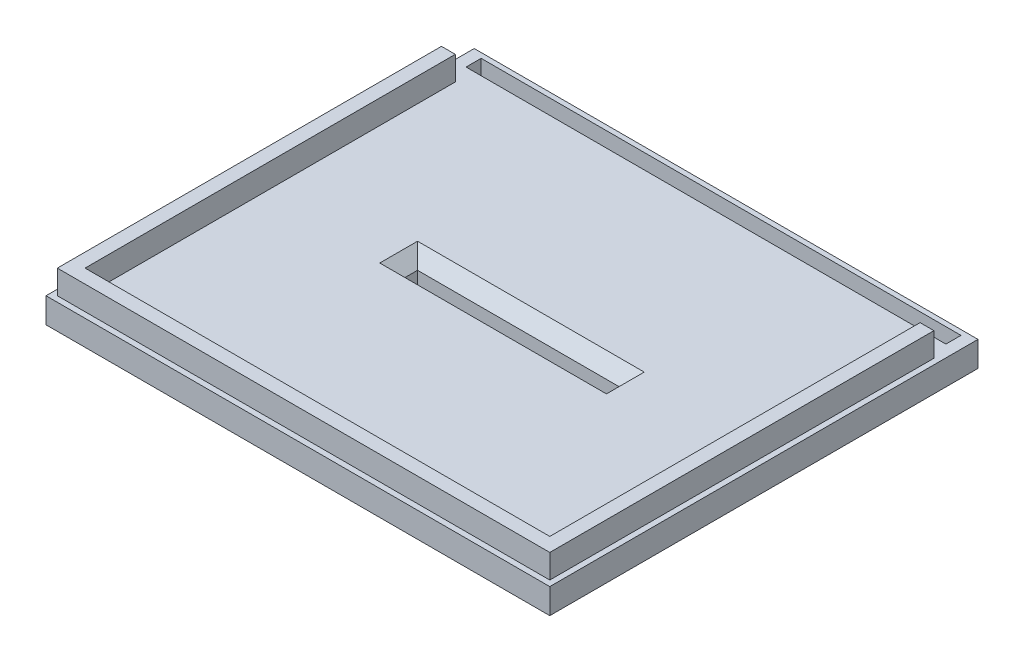
ISO-10303-21;
HEADER;
FILE_DESCRIPTION(('STEP AP214'),'2;1');
FILE_NAME('part.step','',(''),(''),'','','');
FILE_SCHEMA(('AUTOMOTIVE_DESIGN { 1 0 10303 214 1 1 1 1 }'));
ENDSEC;
DATA;
#1=APPLICATION_CONTEXT('core data for automotive mechanical design processes');
#2=APPLICATION_PROTOCOL_DEFINITION('international standard','automotive_design',2000,#1);
#3=PRODUCT_CONTEXT('',#1,'mechanical');
#4=PRODUCT('Part','Part','',(#3));
#5=PRODUCT_RELATED_PRODUCT_CATEGORY('part','',(#4));
#6=PRODUCT_DEFINITION_FORMATION('','',#4);
#7=PRODUCT_DEFINITION_CONTEXT('part definition',#1,'design');
#8=PRODUCT_DEFINITION('design','',#6,#7);
#9=PRODUCT_DEFINITION_SHAPE('','',#8);
#10=(LENGTH_UNIT() NAMED_UNIT(*) SI_UNIT(.MILLI.,.METRE.));
#11=(NAMED_UNIT(*) PLANE_ANGLE_UNIT() SI_UNIT($,.RADIAN.));
#12=(NAMED_UNIT(*) SI_UNIT($,.STERADIAN.) SOLID_ANGLE_UNIT());
#13=UNCERTAINTY_MEASURE_WITH_UNIT(LENGTH_MEASURE(1.E-05),#10,'distance_accuracy_value','');
#14=(GEOMETRIC_REPRESENTATION_CONTEXT(3) GLOBAL_UNCERTAINTY_ASSIGNED_CONTEXT((#13)) GLOBAL_UNIT_ASSIGNED_CONTEXT((#10,
#11,#12)) REPRESENTATION_CONTEXT('',''));
#15=CARTESIAN_POINT('',(0.,0.,0.));
#16=DIRECTION('',(0.,0.,1.));
#17=DIRECTION('',(1.,0.,0.));
#18=AXIS2_PLACEMENT_3D('',#15,#16,#17);
#19=CARTESIAN_POINT('',(0.,0.,0.));
#20=DIRECTION('',(0.,1.,0.));
#21=DIRECTION('',(0.,0.,1.));
#22=AXIS2_PLACEMENT_3D('',#19,#20,#21);
#23=PLANE('',#22);
#24=DIRECTION('',(0.,0.,1.));
#25=VECTOR('',#24,1.);
#26=CARTESIAN_POINT('',(39.9999999999999,0.,-2.5));
#27=LINE('',#26,#25);
#28=CARTESIAN_POINT('',(39.9999999999999,0.,-2.5));
#29=VERTEX_POINT('',#28);
#30=CARTESIAN_POINT('',(39.9999999999999,0.,2.5));
#31=VERTEX_POINT('',#30);
#32=EDGE_CURVE('E330',#29,#31,#27,.T.);
#33=ORIENTED_EDGE('',*,*,#32,.F.);
#34=DIRECTION('',(1.,0.,0.));
#35=VECTOR('',#34,1.);
#36=CARTESIAN_POINT('',(-40.,0.,-2.5));
#37=LINE('',#36,#35);
#38=CARTESIAN_POINT('',(-40.,0.,-2.5));
#39=VERTEX_POINT('',#38);
#40=EDGE_CURVE('E327',#39,#29,#37,.T.);
#41=ORIENTED_EDGE('',*,*,#40,.F.);
#42=DIRECTION('',(0.,0.,-1.));
#43=VECTOR('',#42,1.);
#44=CARTESIAN_POINT('',(-40.,0.,-2.5));
#45=LINE('',#44,#43);
#46=CARTESIAN_POINT('',(-40.,0.,2.5));
#47=VERTEX_POINT('',#46);
#48=EDGE_CURVE('E336',#47,#39,#45,.T.);
#49=ORIENTED_EDGE('',*,*,#48,.F.);
#50=DIRECTION('',(-1.,0.,0.));
#51=VECTOR('',#50,1.);
#52=CARTESIAN_POINT('',(-40.,0.,2.5));
#53=LINE('',#52,#51);
#54=EDGE_CURVE('E333',#31,#47,#53,.T.);
#55=ORIENTED_EDGE('',*,*,#54,.F.);
#56=EDGE_LOOP('',(#33,#41,#49,#55));
#57=FACE_BOUND('',#56,.T.);
#58=DIRECTION('',(1.,0.,0.));
#59=VECTOR('',#58,1.);
#60=CARTESIAN_POINT('',(-44.,0.,-5.25));
#61=LINE('',#60,#59);
#62=CARTESIAN_POINT('',(-44.,0.,-5.25));
#63=VERTEX_POINT('',#62);
#64=CARTESIAN_POINT('',(45.9999999999999,0.,-5.25));
#65=VERTEX_POINT('',#64);
#66=EDGE_CURVE('E289',#63,#65,#61,.T.);
#67=ORIENTED_EDGE('',*,*,#66,.T.);
#68=DIRECTION('',(0.,0.,-1.));
#69=VECTOR('',#68,1.);
#70=CARTESIAN_POINT('',(46.,0.,0.));
#71=LINE('',#70,#69);
#72=CARTESIAN_POINT('',(46.,0.,-7.25));
#73=VERTEX_POINT('',#72);
#74=EDGE_CURVE('E306',#65,#73,#71,.T.);
#75=ORIENTED_EDGE('',*,*,#74,.T.);
#76=DIRECTION('',(1.,0.,0.));
#77=VECTOR('',#76,1.);
#78=CARTESIAN_POINT('',(0.,0.,-7.25));
#79=LINE('',#78,#77);
#80=CARTESIAN_POINT('',(-46.,0.,-7.25));
#81=VERTEX_POINT('',#80);
#82=EDGE_CURVE('E312',#81,#73,#79,.T.);
#83=ORIENTED_EDGE('',*,*,#82,.F.);
#84=DIRECTION('',(0.,0.,-1.));
#85=VECTOR('',#84,1.);
#86=CARTESIAN_POINT('',(-46.,0.,0.));
#87=LINE('',#86,#85);
#88=CARTESIAN_POINT('',(-46.,0.,7.25));
#89=VERTEX_POINT('',#88);
#90=EDGE_CURVE('E309',#89,#81,#87,.T.);
#91=ORIENTED_EDGE('',*,*,#90,.F.);
#92=DIRECTION('',(1.,0.,0.));
#93=VECTOR('',#92,1.);
#94=CARTESIAN_POINT('',(0.,0.,7.25));
#95=LINE('',#94,#93);
#96=CARTESIAN_POINT('',(45.9999999999999,0.,7.25));
#97=VERTEX_POINT('',#96);
#98=EDGE_CURVE('E83',#89,#97,#95,.T.);
#99=ORIENTED_EDGE('',*,*,#98,.T.);
#100=CARTESIAN_POINT('',(46.,0.,5.25));
#101=VERTEX_POINT('',#100);
#102=EDGE_CURVE('E270',#97,#101,#71,.T.);
#103=ORIENTED_EDGE('',*,*,#102,.T.);
#104=DIRECTION('',(1.,0.,0.));
#105=VECTOR('',#104,1.);
#106=CARTESIAN_POINT('',(-44.,0.,5.25));
#107=LINE('',#106,#105);
#108=CARTESIAN_POINT('',(-44.,0.,5.25));
#109=VERTEX_POINT('',#108);
#110=EDGE_CURVE('E267',#109,#101,#107,.T.);
#111=ORIENTED_EDGE('',*,*,#110,.F.);
#112=DIRECTION('',(0.,0.,1.));
#113=VECTOR('',#112,1.);
#114=CARTESIAN_POINT('',(-44.,0.,0.));
#115=LINE('',#114,#113);
#116=EDGE_CURVE('E258',#63,#109,#115,.T.);
#117=ORIENTED_EDGE('',*,*,#116,.F.);
#118=EDGE_LOOP('',(#67,#75,#83,#91,#99,#103,#111,#117));
#119=FACE_BOUND('',#118,.T.);
#120=DIRECTION('',(1.,0.,0.));
#121=VECTOR('',#120,1.);
#122=CARTESIAN_POINT('',(0.,0.,-83.));
#123=LINE('',#122,#121);
#124=CARTESIAN_POINT('',(-95.2500000000001,0.,-83.));
#125=VERTEX_POINT('',#124);
#126=CARTESIAN_POINT('',(95.2499999999999,0.,-83.));
#127=VERTEX_POINT('',#126);
#128=EDGE_CURVE('E376',#125,#127,#123,.T.);
#129=ORIENTED_EDGE('',*,*,#128,.F.);
#130=DIRECTION('',(0.,0.,-1.));
#131=VECTOR('',#130,1.);
#132=CARTESIAN_POINT('',(-95.2499999999998,0.,2.22044604925031E-13));
#133=LINE('',#132,#131);
#134=CARTESIAN_POINT('',(-95.2499999999999,0.,-76.9999999999999));
#135=VERTEX_POINT('',#134);
#136=EDGE_CURVE('E362',#135,#125,#133,.T.);
#137=ORIENTED_EDGE('',*,*,#136,.F.);
#138=DIRECTION('',(1.,0.,0.));
#139=VECTOR('',#138,1.);
#140=CARTESIAN_POINT('',(0.,0.,-77.));
#141=LINE('',#140,#139);
#142=CARTESIAN_POINT('',(95.25,0.,-77.));
#143=VERTEX_POINT('',#142);
#144=EDGE_CURVE('E370',#135,#143,#141,.T.);
#145=ORIENTED_EDGE('',*,*,#144,.T.);
#146=DIRECTION('',(0.,0.,-1.));
#147=VECTOR('',#146,1.);
#148=CARTESIAN_POINT('',(95.2499999999999,0.,0.));
#149=LINE('',#148,#147);
#150=EDGE_CURVE('E373',#143,#127,#149,.T.);
#151=ORIENTED_EDGE('',*,*,#150,.T.);
#152=EDGE_LOOP('',(#129,#137,#145,#151));
#153=FACE_BOUND('',#152,.T.);
#154=DIRECTION('',(0.,0.,-1.));
#155=VECTOR('',#154,1.);
#156=CARTESIAN_POINT('',(-100.,0.,0.));
#157=LINE('',#156,#155);
#158=CARTESIAN_POINT('',(-100.,0.,85.));
#159=VERTEX_POINT('',#158);
#160=CARTESIAN_POINT('',(-100.,0.,-85.));
#161=VERTEX_POINT('',#160);
#162=EDGE_CURVE('E435',#159,#161,#157,.T.);
#163=ORIENTED_EDGE('',*,*,#162,.T.);
#164=DIRECTION('',(1.,0.,0.));
#165=VECTOR('',#164,1.);
#166=CARTESIAN_POINT('',(-100.,0.,-85.));
#167=LINE('',#166,#165);
#168=CARTESIAN_POINT('',(99.9999999999999,0.,-85.));
#169=VERTEX_POINT('',#168);
#170=EDGE_CURVE('E406',#161,#169,#167,.T.);
#171=ORIENTED_EDGE('',*,*,#170,.T.);
#172=DIRECTION('',(0.,0.,-1.));
#173=VECTOR('',#172,1.);
#174=CARTESIAN_POINT('',(99.9999999999999,0.,85.));
#175=LINE('',#174,#173);
#176=CARTESIAN_POINT('',(99.9999999999999,0.,85.));
#177=VERTEX_POINT('',#176);
#178=EDGE_CURVE('E451',#177,#169,#175,.T.);
#179=ORIENTED_EDGE('',*,*,#178,.F.);
#180=DIRECTION('',(1.,0.,0.));
#181=VECTOR('',#180,1.);
#182=CARTESIAN_POINT('',(0.,0.,85.));
#183=LINE('',#182,#181);
#184=EDGE_CURVE('E431',#159,#177,#183,.T.);
#185=ORIENTED_EDGE('',*,*,#184,.F.);
#186=EDGE_LOOP('',(#163,#171,#179,#185));
#187=FACE_BOUND('',#186,.T.);
#188=ADVANCED_FACE('F57',(#57,#119,#153,#187),#23,.F.);
#189=CARTESIAN_POINT('',(0.,10.,0.));
#190=DIRECTION('',(0.,1.,0.));
#191=DIRECTION('',(0.,0.,1.));
#192=AXIS2_PLACEMENT_3D('',#189,#190,#191);
#193=PLANE('',#192);
#194=DIRECTION('',(-1.,0.,0.));
#195=VECTOR('',#194,1.);
#196=CARTESIAN_POINT('',(-40.,10.,7.50000000000001));
#197=LINE('',#196,#195);
#198=CARTESIAN_POINT('',(45.,9.99999999999995,7.50000000000001));
#199=VERTEX_POINT('',#198);
#200=CARTESIAN_POINT('',(-45.,10.,7.50000000000001));
#201=VERTEX_POINT('',#200);
#202=EDGE_CURVE('E485',#199,#201,#197,.T.);
#203=ORIENTED_EDGE('',*,*,#202,.T.);
#204=DIRECTION('',(0.,0.,-1.));
#205=VECTOR('',#204,1.);
#206=CARTESIAN_POINT('',(-45.,10.,-2.5));
#207=LINE('',#206,#205);
#208=CARTESIAN_POINT('',(-45.,9.99999999999995,-7.50000000000001));
#209=VERTEX_POINT('',#208);
#210=EDGE_CURVE('E487',#201,#209,#207,.T.);
#211=ORIENTED_EDGE('',*,*,#210,.T.);
#212=DIRECTION('',(1.,0.,0.));
#213=VECTOR('',#212,1.);
#214=CARTESIAN_POINT('',(40.,9.99999999999995,-7.5));
#215=LINE('',#214,#213);
#216=CARTESIAN_POINT('',(44.9999999999999,9.99999999999995,-7.5));
#217=VERTEX_POINT('',#216);
#218=EDGE_CURVE('E481',#209,#217,#215,.T.);
#219=ORIENTED_EDGE('',*,*,#218,.T.);
#220=DIRECTION('',(0.,0.,1.));
#221=VECTOR('',#220,1.);
#222=CARTESIAN_POINT('',(44.9999999999999,9.99999999999995,2.50000000000001));
#223=LINE('',#222,#221);
#224=EDGE_CURVE('E483',#217,#199,#223,.T.);
#225=ORIENTED_EDGE('',*,*,#224,.T.);
#226=EDGE_LOOP('',(#203,#211,#219,#225));
#227=FACE_BOUND('',#226,.T.);
#228=DIRECTION('',(-1.,0.,0.));
#229=VECTOR('',#228,1.);
#230=CARTESIAN_POINT('',(0.,10.,-69.75));
#231=LINE('',#230,#229);
#232=CARTESIAN_POINT('',(-92.25,10.,-69.75));
#233=VERTEX_POINT('',#232);
#234=CARTESIAN_POINT('',(-97.75,10.,-69.75));
#235=VERTEX_POINT('',#234);
#236=EDGE_CURVE('E478',#233,#235,#231,.T.);
#237=ORIENTED_EDGE('',*,*,#236,.F.);
#238=DIRECTION('',(0.,0.,-1.));
#239=VECTOR('',#238,1.);
#240=CARTESIAN_POINT('',(-92.25,9.99999999999995,0.));
#241=LINE('',#240,#239);
#242=CARTESIAN_POINT('',(-92.2499999999999,10.,77.25));
#243=VERTEX_POINT('',#242);
#244=EDGE_CURVE('E446',#243,#233,#241,.T.);
#245=ORIENTED_EDGE('',*,*,#244,.F.);
#246=DIRECTION('',(-1.,0.,0.));
#247=VECTOR('',#246,1.);
#248=CARTESIAN_POINT('',(0.,10.,77.2500000000001));
#249=LINE('',#248,#247);
#250=CARTESIAN_POINT('',(92.2499999999999,10.,77.25));
#251=VERTEX_POINT('',#250);
#252=EDGE_CURVE('E460',#251,#243,#249,.T.);
#253=ORIENTED_EDGE('',*,*,#252,.F.);
#254=DIRECTION('',(0.,0.,1.));
#255=VECTOR('',#254,1.);
#256=CARTESIAN_POINT('',(92.2499999999999,9.99999999999995,0.));
#257=LINE('',#256,#255);
#258=CARTESIAN_POINT('',(92.25,10.,-69.75));
#259=VERTEX_POINT('',#258);
#260=EDGE_CURVE('E463',#259,#251,#257,.T.);
#261=ORIENTED_EDGE('',*,*,#260,.F.);
#262=DIRECTION('',(-1.,0.,0.));
#263=VECTOR('',#262,1.);
#264=CARTESIAN_POINT('',(0.,10.,-69.75));
#265=LINE('',#264,#263);
#266=CARTESIAN_POINT('',(97.7499999999999,10.,-69.75));
#267=VERTEX_POINT('',#266);
#268=EDGE_CURVE('E466',#267,#259,#265,.T.);
#269=ORIENTED_EDGE('',*,*,#268,.F.);
#270=DIRECTION('',(0.,0.,-1.));
#271=VECTOR('',#270,1.);
#272=CARTESIAN_POINT('',(97.7499999999999,9.99999999999995,0.));
#273=LINE('',#272,#271);
#274=CARTESIAN_POINT('',(97.7499999999999,10.,82.75));
#275=VERTEX_POINT('',#274);
#276=EDGE_CURVE('E469',#275,#267,#273,.T.);
#277=ORIENTED_EDGE('',*,*,#276,.F.);
#278=DIRECTION('',(1.,0.,0.));
#279=VECTOR('',#278,1.);
#280=CARTESIAN_POINT('',(0.,10.,82.75));
#281=LINE('',#280,#279);
#282=CARTESIAN_POINT('',(-97.75,10.,82.75));
#283=VERTEX_POINT('',#282);
#284=EDGE_CURVE('E472',#283,#275,#281,.T.);
#285=ORIENTED_EDGE('',*,*,#284,.F.);
#286=DIRECTION('',(0.,0.,1.));
#287=VECTOR('',#286,1.);
#288=CARTESIAN_POINT('',(-97.7499999999999,9.99999999999995,0.));
#289=LINE('',#288,#287);
#290=EDGE_CURVE('E475',#235,#283,#289,.T.);
#291=ORIENTED_EDGE('',*,*,#290,.F.);
#292=EDGE_LOOP('',(#237,#245,#253,#261,#269,#277,#285,#291));
#293=FACE_BOUND('',#292,.T.);
#294=DIRECTION('',(1.,0.,0.));
#295=VECTOR('',#294,1.);
#296=CARTESIAN_POINT('',(0.,10.,85.));
#297=LINE('',#296,#295);
#298=CARTESIAN_POINT('',(-100.,10.,85.));
#299=VERTEX_POINT('',#298);
#300=CARTESIAN_POINT('',(100.,10.,85.));
#301=VERTEX_POINT('',#300);
#302=EDGE_CURVE('E430',#299,#301,#297,.T.);
#303=ORIENTED_EDGE('',*,*,#302,.T.);
#304=DIRECTION('',(0.,0.,-1.));
#305=VECTOR('',#304,1.);
#306=CARTESIAN_POINT('',(100.,10.,85.));
#307=LINE('',#306,#305);
#308=CARTESIAN_POINT('',(99.9999999999999,10.,-85.));
#309=VERTEX_POINT('',#308);
#310=EDGE_CURVE('E450',#301,#309,#307,.T.);
#311=ORIENTED_EDGE('',*,*,#310,.T.);
#312=DIRECTION('',(1.,0.,0.));
#313=VECTOR('',#312,1.);
#314=CARTESIAN_POINT('',(-100.,10.,-85.));
#315=LINE('',#314,#313);
#316=CARTESIAN_POINT('',(-100.,10.,-85.));
#317=VERTEX_POINT('',#316);
#318=EDGE_CURVE('E447',#317,#309,#315,.T.);
#319=ORIENTED_EDGE('',*,*,#318,.F.);
#320=DIRECTION('',(0.,0.,-1.));
#321=VECTOR('',#320,1.);
#322=CARTESIAN_POINT('',(-100.,9.99999999999995,0.));
#323=LINE('',#322,#321);
#324=EDGE_CURVE('E427',#299,#317,#323,.T.);
#325=ORIENTED_EDGE('',*,*,#324,.F.);
#326=EDGE_LOOP('',(#303,#311,#319,#325));
#327=FACE_BOUND('',#326,.T.);
#328=DIRECTION('',(0.,0.,-1.));
#329=VECTOR('',#328,1.);
#330=CARTESIAN_POINT('',(-95.2499999999998,9.99999999999995,2.25514051876985E-13));
#331=LINE('',#330,#329);
#332=CARTESIAN_POINT('',(-95.2499999999999,10.,-77.));
#333=VERTEX_POINT('',#332);
#334=CARTESIAN_POINT('',(-95.2500000000001,10.,-83.));
#335=VERTEX_POINT('',#334);
#336=EDGE_CURVE('E350',#333,#335,#331,.T.);
#337=ORIENTED_EDGE('',*,*,#336,.T.);
#338=DIRECTION('',(1.,0.,0.));
#339=VECTOR('',#338,1.);
#340=CARTESIAN_POINT('',(0.,10.,-83.));
#341=LINE('',#340,#339);
#342=CARTESIAN_POINT('',(95.2499999999999,10.,-83.));
#343=VERTEX_POINT('',#342);
#344=EDGE_CURVE('E342',#335,#343,#341,.T.);
#345=ORIENTED_EDGE('',*,*,#344,.T.);
#346=DIRECTION('',(0.,0.,-1.));
#347=VECTOR('',#346,1.);
#348=CARTESIAN_POINT('',(95.2499999999999,9.99999999999995,0.));
#349=LINE('',#348,#347);
#350=CARTESIAN_POINT('',(95.25,10.,-77.));
#351=VERTEX_POINT('',#350);
#352=EDGE_CURVE('E356',#351,#343,#349,.T.);
#353=ORIENTED_EDGE('',*,*,#352,.F.);
#354=DIRECTION('',(1.,0.,0.));
#355=VECTOR('',#354,1.);
#356=CARTESIAN_POINT('',(0.,10.,-77.));
#357=LINE('',#356,#355);
#358=EDGE_CURVE('E353',#333,#351,#357,.T.);
#359=ORIENTED_EDGE('',*,*,#358,.F.);
#360=EDGE_LOOP('',(#337,#345,#353,#359));
#361=FACE_BOUND('',#360,.T.);
#362=ADVANCED_FACE('F538',(#227,#293,#327,#361),#193,.T.);
#363=CARTESIAN_POINT('',(0.,10.,85.));
#364=DIRECTION('',(0.,0.,-1.));
#365=DIRECTION('',(-1.,0.,0.));
#366=AXIS2_PLACEMENT_3D('',#363,#364,#365);
#367=PLANE('',#366);
#368=ORIENTED_EDGE('',*,*,#184,.T.);
#369=DIRECTION('',(0.,-1.,0.));
#370=VECTOR('',#369,1.);
#371=CARTESIAN_POINT('',(100.,10.,85.));
#372=LINE('',#371,#370);
#373=EDGE_CURVE('E434',#301,#177,#372,.T.);
#374=ORIENTED_EDGE('',*,*,#373,.F.);
#375=ORIENTED_EDGE('',*,*,#302,.F.);
#376=DIRECTION('',(0.,-1.,0.));
#377=VECTOR('',#376,1.);
#378=CARTESIAN_POINT('',(-100.,10.,85.));
#379=LINE('',#378,#377);
#380=EDGE_CURVE('E442',#299,#159,#379,.T.);
#381=ORIENTED_EDGE('',*,*,#380,.T.);
#382=EDGE_LOOP('',(#368,#374,#375,#381));
#383=FACE_BOUND('',#382,.T.);
#384=ADVANCED_FACE('F541',(#383),#367,.F.);
#385=CARTESIAN_POINT('',(-100.,9.99999999999995,0.));
#386=DIRECTION('',(-1.,0.,0.));
#387=DIRECTION('',(0.,0.,1.));
#388=AXIS2_PLACEMENT_3D('',#385,#386,#387);
#389=PLANE('',#388);
#390=ORIENTED_EDGE('',*,*,#162,.F.);
#391=ORIENTED_EDGE('',*,*,#380,.F.);
#392=ORIENTED_EDGE('',*,*,#324,.T.);
#393=DIRECTION('',(0.,-1.,0.));
#394=VECTOR('',#393,1.);
#395=CARTESIAN_POINT('',(-100.,10.,-85.));
#396=LINE('',#395,#394);
#397=EDGE_CURVE('E444',#317,#161,#396,.T.);
#398=ORIENTED_EDGE('',*,*,#397,.T.);
#399=EDGE_LOOP('',(#390,#391,#392,#398));
#400=FACE_BOUND('',#399,.T.);
#401=ADVANCED_FACE('F581',(#400),#389,.T.);
#402=CARTESIAN_POINT('',(-100.,10.,-85.));
#403=DIRECTION('',(0.,0.,-1.));
#404=DIRECTION('',(-1.,0.,0.));
#405=AXIS2_PLACEMENT_3D('',#402,#403,#404);
#406=PLANE('',#405);
#407=ORIENTED_EDGE('',*,*,#170,.F.);
#408=ORIENTED_EDGE('',*,*,#397,.F.);
#409=ORIENTED_EDGE('',*,*,#318,.T.);
#410=DIRECTION('',(0.,-1.,0.));
#411=VECTOR('',#410,1.);
#412=CARTESIAN_POINT('',(99.9999999999999,10.,-85.));
#413=LINE('',#412,#411);
#414=EDGE_CURVE('E438',#309,#169,#413,.T.);
#415=ORIENTED_EDGE('',*,*,#414,.T.);
#416=EDGE_LOOP('',(#407,#408,#409,#415));
#417=FACE_BOUND('',#416,.T.);
#418=ADVANCED_FACE('F585',(#417),#406,.T.);
#419=CARTESIAN_POINT('',(100.,10.,85.));
#420=DIRECTION('',(-1.,0.,0.));
#421=DIRECTION('',(0.,0.,1.));
#422=AXIS2_PLACEMENT_3D('',#419,#420,#421);
#423=PLANE('',#422);
#424=ORIENTED_EDGE('',*,*,#178,.T.);
#425=ORIENTED_EDGE('',*,*,#414,.F.);
#426=ORIENTED_EDGE('',*,*,#310,.F.);
#427=ORIENTED_EDGE('',*,*,#373,.T.);
#428=EDGE_LOOP('',(#424,#425,#426,#427));
#429=FACE_BOUND('',#428,.T.);
#430=ADVANCED_FACE('F587',(#429),#423,.F.);
#431=CARTESIAN_POINT('',(-97.75,19.5,-69.75));
#432=DIRECTION('',(0.,0.,-1.));
#433=DIRECTION('',(-1.,0.,0.));
#434=AXIS2_PLACEMENT_3D('',#431,#432,#433);
#435=PLANE('',#434);
#436=DIRECTION('',(0.,-1.,0.));
#437=VECTOR('',#436,1.);
#438=CARTESIAN_POINT('',(-92.25,19.5,-69.75));
#439=LINE('',#438,#437);
#440=CARTESIAN_POINT('',(-92.25,19.5,-69.75));
#441=VERTEX_POINT('',#440);
#442=EDGE_CURVE('E402',#441,#233,#439,.T.);
#443=ORIENTED_EDGE('',*,*,#442,.T.);
#444=ORIENTED_EDGE('',*,*,#236,.T.);
#445=DIRECTION('',(0.,-1.,0.));
#446=VECTOR('',#445,1.);
#447=CARTESIAN_POINT('',(-97.75,19.5,-69.75));
#448=LINE('',#447,#446);
#449=CARTESIAN_POINT('',(-97.75,19.5,-69.75));
#450=VERTEX_POINT('',#449);
#451=EDGE_CURVE('E403',#450,#235,#448,.T.);
#452=ORIENTED_EDGE('',*,*,#451,.F.);
#453=DIRECTION('',(1.,0.,0.));
#454=VECTOR('',#453,1.);
#455=CARTESIAN_POINT('',(-97.75,19.5,-69.75));
#456=LINE('',#455,#454);
#457=EDGE_CURVE('E378',#450,#441,#456,.T.);
#458=ORIENTED_EDGE('',*,*,#457,.T.);
#459=EDGE_LOOP('',(#443,#444,#452,#458));
#460=FACE_BOUND('',#459,.T.);
#461=ADVANCED_FACE('F590',(#460),#435,.T.);
#462=CARTESIAN_POINT('',(-97.75,19.5,82.7500000000001));
#463=DIRECTION('',(-1.,0.,0.));
#464=DIRECTION('',(0.,0.,1.));
#465=AXIS2_PLACEMENT_3D('',#462,#463,#464);
#466=PLANE('',#465);
#467=ORIENTED_EDGE('',*,*,#451,.T.);
#468=ORIENTED_EDGE('',*,*,#290,.T.);
#469=DIRECTION('',(0.,-1.,0.));
#470=VECTOR('',#469,1.);
#471=CARTESIAN_POINT('',(-97.75,19.5,82.7500000000001));
#472=LINE('',#471,#470);
#473=CARTESIAN_POINT('',(-97.75,19.5,82.7500000000001));
#474=VERTEX_POINT('',#473);
#475=EDGE_CURVE('E407',#474,#283,#472,.T.);
#476=ORIENTED_EDGE('',*,*,#475,.F.);
#477=DIRECTION('',(0.,0.,-1.));
#478=VECTOR('',#477,1.);
#479=CARTESIAN_POINT('',(-97.75,19.5,82.7500000000001));
#480=LINE('',#479,#478);
#481=EDGE_CURVE('E399',#474,#450,#480,.T.);
#482=ORIENTED_EDGE('',*,*,#481,.T.);
#483=EDGE_LOOP('',(#467,#468,#476,#482));
#484=FACE_BOUND('',#483,.T.);
#485=ADVANCED_FACE('F734',(#484),#466,.T.);
#486=CARTESIAN_POINT('',(97.7499999999999,19.5,82.75));
#487=DIRECTION('',(0.,0.,1.));
#488=DIRECTION('',(1.,0.,0.));
#489=AXIS2_PLACEMENT_3D('',#486,#487,#488);
#490=PLANE('',#489);
#491=ORIENTED_EDGE('',*,*,#475,.T.);
#492=ORIENTED_EDGE('',*,*,#284,.T.);
#493=DIRECTION('',(0.,-1.,0.));
#494=VECTOR('',#493,1.);
#495=CARTESIAN_POINT('',(97.7499999999999,19.5,82.75));
#496=LINE('',#495,#494);
#497=CARTESIAN_POINT('',(97.7499999999999,19.5,82.75));
#498=VERTEX_POINT('',#497);
#499=EDGE_CURVE('E410',#498,#275,#496,.T.);
#500=ORIENTED_EDGE('',*,*,#499,.F.);
#501=DIRECTION('',(-1.,0.,0.));
#502=VECTOR('',#501,1.);
#503=CARTESIAN_POINT('',(97.7499999999999,19.5,82.75));
#504=LINE('',#503,#502);
#505=EDGE_CURVE('E396',#498,#474,#504,.T.);
#506=ORIENTED_EDGE('',*,*,#505,.T.);
#507=EDGE_LOOP('',(#491,#492,#500,#506));
#508=FACE_BOUND('',#507,.T.);
#509=ADVANCED_FACE('F743',(#508),#490,.T.);
#510=CARTESIAN_POINT('',(97.7499999999999,19.5,-69.75));
#511=DIRECTION('',(1.,0.,0.));
#512=DIRECTION('',(0.,0.,-1.));
#513=AXIS2_PLACEMENT_3D('',#510,#511,#512);
#514=PLANE('',#513);
#515=ORIENTED_EDGE('',*,*,#499,.T.);
#516=ORIENTED_EDGE('',*,*,#276,.T.);
#517=DIRECTION('',(0.,-1.,0.));
#518=VECTOR('',#517,1.);
#519=CARTESIAN_POINT('',(97.7499999999999,19.5,-69.75));
#520=LINE('',#519,#518);
#521=CARTESIAN_POINT('',(97.7499999999999,19.5,-69.75));
#522=VERTEX_POINT('',#521);
#523=EDGE_CURVE('E413',#522,#267,#520,.T.);
#524=ORIENTED_EDGE('',*,*,#523,.F.);
#525=DIRECTION('',(0.,0.,1.));
#526=VECTOR('',#525,1.);
#527=CARTESIAN_POINT('',(97.7499999999999,19.5,-69.75));
#528=LINE('',#527,#526);
#529=EDGE_CURVE('E393',#522,#498,#528,.T.);
#530=ORIENTED_EDGE('',*,*,#529,.T.);
#531=EDGE_LOOP('',(#515,#516,#524,#530));
#532=FACE_BOUND('',#531,.T.);
#533=ADVANCED_FACE('F753',(#532),#514,.T.);
#534=CARTESIAN_POINT('',(92.25,19.5,-69.75));
#535=DIRECTION('',(0.,0.,-1.));
#536=DIRECTION('',(-1.,0.,0.));
#537=AXIS2_PLACEMENT_3D('',#534,#535,#536);
#538=PLANE('',#537);
#539=ORIENTED_EDGE('',*,*,#523,.T.);
#540=ORIENTED_EDGE('',*,*,#268,.T.);
#541=DIRECTION('',(0.,-1.,0.));
#542=VECTOR('',#541,1.);
#543=CARTESIAN_POINT('',(92.25,19.5,-69.75));
#544=LINE('',#543,#542);
#545=CARTESIAN_POINT('',(92.25,19.5,-69.75));
#546=VERTEX_POINT('',#545);
#547=EDGE_CURVE('E416',#546,#259,#544,.T.);
#548=ORIENTED_EDGE('',*,*,#547,.F.);
#549=DIRECTION('',(1.,0.,0.));
#550=VECTOR('',#549,1.);
#551=CARTESIAN_POINT('',(92.25,19.5,-69.75));
#552=LINE('',#551,#550);
#553=EDGE_CURVE('E390',#546,#522,#552,.T.);
#554=ORIENTED_EDGE('',*,*,#553,.T.);
#555=EDGE_LOOP('',(#539,#540,#548,#554));
#556=FACE_BOUND('',#555,.T.);
#557=ADVANCED_FACE('F763',(#556),#538,.T.);
#558=CARTESIAN_POINT('',(92.2499999999999,19.5,77.25));
#559=DIRECTION('',(-1.,0.,0.));
#560=DIRECTION('',(0.,0.,1.));
#561=AXIS2_PLACEMENT_3D('',#558,#559,#560);
#562=PLANE('',#561);
#563=ORIENTED_EDGE('',*,*,#547,.T.);
#564=ORIENTED_EDGE('',*,*,#260,.T.);
#565=DIRECTION('',(0.,-1.,0.));
#566=VECTOR('',#565,1.);
#567=CARTESIAN_POINT('',(92.2499999999999,19.5,77.25));
#568=LINE('',#567,#566);
#569=CARTESIAN_POINT('',(92.2499999999999,19.5,77.25));
#570=VERTEX_POINT('',#569);
#571=EDGE_CURVE('E419',#570,#251,#568,.T.);
#572=ORIENTED_EDGE('',*,*,#571,.F.);
#573=DIRECTION('',(0.,0.,-1.));
#574=VECTOR('',#573,1.);
#575=CARTESIAN_POINT('',(92.2499999999999,19.5,77.25));
#576=LINE('',#575,#574);
#577=EDGE_CURVE('E387',#570,#546,#576,.T.);
#578=ORIENTED_EDGE('',*,*,#577,.T.);
#579=EDGE_LOOP('',(#563,#564,#572,#578));
#580=FACE_BOUND('',#579,.T.);
#581=ADVANCED_FACE('F773',(#580),#562,.T.);
#582=CARTESIAN_POINT('',(-92.2499999999999,19.5,77.25));
#583=DIRECTION('',(0.,0.,-1.));
#584=DIRECTION('',(-1.,0.,0.));
#585=AXIS2_PLACEMENT_3D('',#582,#583,#584);
#586=PLANE('',#585);
#587=ORIENTED_EDGE('',*,*,#571,.T.);
#588=ORIENTED_EDGE('',*,*,#252,.T.);
#589=DIRECTION('',(0.,-1.,0.));
#590=VECTOR('',#589,1.);
#591=CARTESIAN_POINT('',(-92.2499999999999,19.5,77.25));
#592=LINE('',#591,#590);
#593=CARTESIAN_POINT('',(-92.2499999999999,19.5,77.25));
#594=VERTEX_POINT('',#593);
#595=EDGE_CURVE('E422',#594,#243,#592,.T.);
#596=ORIENTED_EDGE('',*,*,#595,.F.);
#597=DIRECTION('',(1.,0.,0.));
#598=VECTOR('',#597,1.);
#599=CARTESIAN_POINT('',(-92.2499999999999,19.5,77.25));
#600=LINE('',#599,#598);
#601=EDGE_CURVE('E384',#594,#570,#600,.T.);
#602=ORIENTED_EDGE('',*,*,#601,.T.);
#603=EDGE_LOOP('',(#587,#588,#596,#602));
#604=FACE_BOUND('',#603,.T.);
#605=ADVANCED_FACE('F783',(#604),#586,.T.);
#606=CARTESIAN_POINT('',(-92.25,19.5,-69.75));
#607=DIRECTION('',(1.,0.,0.));
#608=DIRECTION('',(0.,0.,-1.));
#609=AXIS2_PLACEMENT_3D('',#606,#607,#608);
#610=PLANE('',#609);
#611=ORIENTED_EDGE('',*,*,#595,.T.);
#612=ORIENTED_EDGE('',*,*,#244,.T.);
#613=ORIENTED_EDGE('',*,*,#442,.F.);
#614=DIRECTION('',(0.,0.,1.));
#615=VECTOR('',#614,1.);
#616=CARTESIAN_POINT('',(-92.25,19.5,-69.75));
#617=LINE('',#616,#615);
#618=EDGE_CURVE('E381',#441,#594,#617,.T.);
#619=ORIENTED_EDGE('',*,*,#618,.T.);
#620=EDGE_LOOP('',(#611,#612,#613,#619));
#621=FACE_BOUND('',#620,.T.);
#622=ADVANCED_FACE('F793',(#621),#610,.T.);
#623=CARTESIAN_POINT('',(0.,19.5,0.));
#624=DIRECTION('',(0.,-1.,0.));
#625=DIRECTION('',(0.,0.,-1.));
#626=AXIS2_PLACEMENT_3D('',#623,#624,#625);
#627=PLANE('',#626);
#628=ORIENTED_EDGE('',*,*,#457,.F.);
#629=ORIENTED_EDGE('',*,*,#481,.F.);
#630=ORIENTED_EDGE('',*,*,#505,.F.);
#631=ORIENTED_EDGE('',*,*,#529,.F.);
#632=ORIENTED_EDGE('',*,*,#553,.F.);
#633=ORIENTED_EDGE('',*,*,#577,.F.);
#634=ORIENTED_EDGE('',*,*,#601,.F.);
#635=ORIENTED_EDGE('',*,*,#618,.F.);
#636=EDGE_LOOP('',(#628,#629,#630,#631,#632,#633,#634,#635));
#637=FACE_BOUND('',#636,.T.);
#638=ADVANCED_FACE('F803',(#637),#627,.F.);
#639=CARTESIAN_POINT('',(0.,-9.99999999999995,-83.));
#640=DIRECTION('',(0.,0.,1.));
#641=DIRECTION('',(1.,0.,0.));
#642=AXIS2_PLACEMENT_3D('',#639,#640,#641);
#643=PLANE('',#642);
#644=ORIENTED_EDGE('',*,*,#128,.T.);
#645=DIRECTION('',(0.,1.,0.));
#646=VECTOR('',#645,1.);
#647=CARTESIAN_POINT('',(95.2499999999999,-10.,-83.));
#648=LINE('',#647,#646);
#649=EDGE_CURVE('E360',#127,#343,#648,.T.);
#650=ORIENTED_EDGE('',*,*,#649,.T.);
#651=ORIENTED_EDGE('',*,*,#344,.F.);
#652=DIRECTION('',(0.,1.,0.));
#653=VECTOR('',#652,1.);
#654=CARTESIAN_POINT('',(-95.2500000000001,-10.,-83.));
#655=LINE('',#654,#653);
#656=EDGE_CURVE('E359',#125,#335,#655,.T.);
#657=ORIENTED_EDGE('',*,*,#656,.F.);
#658=EDGE_LOOP('',(#644,#650,#651,#657));
#659=FACE_BOUND('',#658,.T.);
#660=ADVANCED_FACE('F557',(#659),#643,.T.);
#661=CARTESIAN_POINT('',(95.2499999999999,-10.,0.));
#662=DIRECTION('',(1.,0.,0.));
#663=DIRECTION('',(0.,0.,-1.));
#664=AXIS2_PLACEMENT_3D('',#661,#662,#663);
#665=PLANE('',#664);
#666=DIRECTION('',(0.,1.,0.));
#667=VECTOR('',#666,1.);
#668=CARTESIAN_POINT('',(95.25,-10.,-77.));
#669=LINE('',#668,#667);
#670=EDGE_CURVE('E363',#143,#351,#669,.T.);
#671=ORIENTED_EDGE('',*,*,#670,.T.);
#672=ORIENTED_EDGE('',*,*,#352,.T.);
#673=ORIENTED_EDGE('',*,*,#649,.F.);
#674=ORIENTED_EDGE('',*,*,#150,.F.);
#675=EDGE_LOOP('',(#671,#672,#673,#674));
#676=FACE_BOUND('',#675,.T.);
#677=ADVANCED_FACE('F562',(#676),#665,.F.);
#678=CARTESIAN_POINT('',(0.,-9.99999999999995,-77.));
#679=DIRECTION('',(0.,0.,1.));
#680=DIRECTION('',(1.,0.,0.));
#681=AXIS2_PLACEMENT_3D('',#678,#679,#680);
#682=PLANE('',#681);
#683=DIRECTION('',(0.,1.,0.));
#684=VECTOR('',#683,1.);
#685=CARTESIAN_POINT('',(-95.2499999999999,-10.,-76.9999999999999));
#686=LINE('',#685,#684);
#687=EDGE_CURVE('E365',#135,#333,#686,.T.);
#688=ORIENTED_EDGE('',*,*,#687,.T.);
#689=ORIENTED_EDGE('',*,*,#358,.T.);
#690=ORIENTED_EDGE('',*,*,#670,.F.);
#691=ORIENTED_EDGE('',*,*,#144,.F.);
#692=EDGE_LOOP('',(#688,#689,#690,#691));
#693=FACE_BOUND('',#692,.T.);
#694=ADVANCED_FACE('F564',(#693),#682,.F.);
#695=CARTESIAN_POINT('',(-95.2499999999998,-10.,2.22044604925031E-13));
#696=DIRECTION('',(1.,0.,0.));
#697=DIRECTION('',(0.,0.,-1.));
#698=AXIS2_PLACEMENT_3D('',#695,#696,#697);
#699=PLANE('',#698);
#700=ORIENTED_EDGE('',*,*,#136,.T.);
#701=ORIENTED_EDGE('',*,*,#656,.T.);
#702=ORIENTED_EDGE('',*,*,#336,.F.);
#703=ORIENTED_EDGE('',*,*,#687,.F.);
#704=EDGE_LOOP('',(#700,#701,#702,#703));
#705=FACE_BOUND('',#704,.T.);
#706=ADVANCED_FACE('F551',(#705),#699,.T.);
#707=CARTESIAN_POINT('',(-40.,10.,-2.5));
#708=DIRECTION('',(0.,0.,-1.));
#709=DIRECTION('',(-1.,0.,0.));
#710=AXIS2_PLACEMENT_3D('',#707,#708,#709);
#711=PLANE('',#710);
#712=DIRECTION('',(0.,-1.,0.));
#713=VECTOR('',#712,1.);
#714=CARTESIAN_POINT('',(39.9999999999999,9.99999999999995,-2.5));
#715=LINE('',#714,#713);
#716=CARTESIAN_POINT('',(39.9999999999999,4.99999999999995,-2.5));
#717=VERTEX_POINT('',#716);
#718=EDGE_CURVE('E339',#717,#29,#715,.T.);
#719=ORIENTED_EDGE('',*,*,#718,.F.);
#720=DIRECTION('',(-1.,0.,0.));
#721=VECTOR('',#720,1.);
#722=CARTESIAN_POINT('',(-40.,4.99999999999995,-2.5));
#723=LINE('',#722,#721);
#724=CARTESIAN_POINT('',(-40.,4.99999999999995,-2.5));
#725=VERTEX_POINT('',#724);
#726=EDGE_CURVE('E12',#717,#725,#723,.T.);
#727=ORIENTED_EDGE('',*,*,#726,.T.);
#728=DIRECTION('',(0.,-1.,0.));
#729=VECTOR('',#728,1.);
#730=CARTESIAN_POINT('',(-40.,10.,-2.5));
#731=LINE('',#730,#729);
#732=EDGE_CURVE('E340',#725,#39,#731,.T.);
#733=ORIENTED_EDGE('',*,*,#732,.T.);
#734=ORIENTED_EDGE('',*,*,#40,.T.);
#735=EDGE_LOOP('',(#719,#727,#733,#734));
#736=FACE_BOUND('',#735,.T.);
#737=ADVANCED_FACE('F519',(#736),#711,.F.);
#738=CARTESIAN_POINT('',(-40.,10.,-2.5));
#739=DIRECTION('',(-1.,0.,0.));
#740=DIRECTION('',(0.,0.,1.));
#741=AXIS2_PLACEMENT_3D('',#738,#739,#740);
#742=PLANE('',#741);
#743=ORIENTED_EDGE('',*,*,#732,.F.);
#744=DIRECTION('',(0.,0.,1.));
#745=VECTOR('',#744,1.);
#746=CARTESIAN_POINT('',(-40.,4.99999999999995,2.5));
#747=LINE('',#746,#745);
#748=CARTESIAN_POINT('',(-40.,4.99999999999995,2.5));
#749=VERTEX_POINT('',#748);
#750=EDGE_CURVE('E490',#725,#749,#747,.T.);
#751=ORIENTED_EDGE('',*,*,#750,.T.);
#752=DIRECTION('',(0.,-1.,0.));
#753=VECTOR('',#752,1.);
#754=CARTESIAN_POINT('',(-40.,10.,2.5));
#755=LINE('',#754,#753);
#756=EDGE_CURVE('E343',#749,#47,#755,.T.);
#757=ORIENTED_EDGE('',*,*,#756,.T.);
#758=ORIENTED_EDGE('',*,*,#48,.T.);
#759=EDGE_LOOP('',(#743,#751,#757,#758));
#760=FACE_BOUND('',#759,.T.);
#761=ADVANCED_FACE('F530',(#760),#742,.F.);
#762=CARTESIAN_POINT('',(-40.,10.,2.5));
#763=DIRECTION('',(0.,0.,1.));
#764=DIRECTION('',(1.,0.,0.));
#765=AXIS2_PLACEMENT_3D('',#762,#763,#764);
#766=PLANE('',#765);
#767=ORIENTED_EDGE('',*,*,#756,.F.);
#768=DIRECTION('',(1.,0.,0.));
#769=VECTOR('',#768,1.);
#770=CARTESIAN_POINT('',(39.9999999999999,4.99999999999995,2.5));
#771=LINE('',#770,#769);
#772=CARTESIAN_POINT('',(39.9999999999999,4.99999999999995,2.5));
#773=VERTEX_POINT('',#772);
#774=EDGE_CURVE('E493',#749,#773,#771,.T.);
#775=ORIENTED_EDGE('',*,*,#774,.T.);
#776=DIRECTION('',(0.,-1.,0.));
#777=VECTOR('',#776,1.);
#778=CARTESIAN_POINT('',(39.9999999999999,9.99999999999995,2.5));
#779=LINE('',#778,#777);
#780=EDGE_CURVE('E345',#773,#31,#779,.T.);
#781=ORIENTED_EDGE('',*,*,#780,.T.);
#782=ORIENTED_EDGE('',*,*,#54,.T.);
#783=EDGE_LOOP('',(#767,#775,#781,#782));
#784=FACE_BOUND('',#783,.T.);
#785=ADVANCED_FACE('F528',(#784),#766,.F.);
#786=CARTESIAN_POINT('',(39.9999999999999,9.99999999999995,-2.5));
#787=DIRECTION('',(1.,0.,0.));
#788=DIRECTION('',(0.,0.,-1.));
#789=AXIS2_PLACEMENT_3D('',#786,#787,#788);
#790=PLANE('',#789);
#791=ORIENTED_EDGE('',*,*,#780,.F.);
#792=DIRECTION('',(0.,0.,-1.));
#793=VECTOR('',#792,1.);
#794=CARTESIAN_POINT('',(39.9999999999999,4.99999999999995,-2.5));
#795=LINE('',#794,#793);
#796=EDGE_CURVE('E67',#773,#717,#795,.T.);
#797=ORIENTED_EDGE('',*,*,#796,.T.);
#798=ORIENTED_EDGE('',*,*,#718,.T.);
#799=ORIENTED_EDGE('',*,*,#32,.T.);
#800=EDGE_LOOP('',(#791,#797,#798,#799));
#801=FACE_BOUND('',#800,.T.);
#802=ADVANCED_FACE('F517',(#801),#790,.F.);
#803=CARTESIAN_POINT('',(45.,9.99999999999995,0.));
#804=DIRECTION('',(-0.707106781186549,0.707106781186545,0.));
#805=DIRECTION('',(0.,0.,-1.));
#806=AXIS2_PLACEMENT_3D('',#803,#804,#805);
#807=PLANE('',#806);
#808=DIRECTION('',(0.577350269189625,0.577350269189628,-0.577350269189625));
#809=VECTOR('',#808,1.);
#810=CARTESIAN_POINT('',(42.5,7.49999999999995,-5.00000000000001));
#811=LINE('',#810,#809);
#812=EDGE_CURVE('E498',#717,#217,#811,.T.);
#813=ORIENTED_EDGE('',*,*,#812,.F.);
#814=ORIENTED_EDGE('',*,*,#796,.F.);
#815=DIRECTION('',(0.577350269189625,0.577350269189628,0.577350269189625));
#816=VECTOR('',#815,1.);
#817=CARTESIAN_POINT('',(30.0000000000001,-5.00000000000006,-7.49999999999994));
#818=LINE('',#817,#816);
#819=EDGE_CURVE('E62',#199,#773,#818,.F.);
#820=ORIENTED_EDGE('',*,*,#819,.F.);
#821=ORIENTED_EDGE('',*,*,#224,.F.);
#822=EDGE_LOOP('',(#813,#814,#820,#821));
#823=FACE_BOUND('',#822,.T.);
#824=ADVANCED_FACE('F60',(#823),#807,.T.);
#825=CARTESIAN_POINT('',(0.,10.,7.50000000000001));
#826=DIRECTION('',(0.,0.707106781186545,-0.707106781186549));
#827=DIRECTION('',(1.,0.,0.));
#828=AXIS2_PLACEMENT_3D('',#825,#826,#827);
#829=PLANE('',#828);
#830=ORIENTED_EDGE('',*,*,#819,.T.);
#831=ORIENTED_EDGE('',*,*,#774,.F.);
#832=DIRECTION('',(-0.577350269189625,0.577350269189628,0.577350269189625));
#833=VECTOR('',#832,1.);
#834=CARTESIAN_POINT('',(-42.5,7.50000000000001,5.00000000000001));
#835=LINE('',#834,#833);
#836=EDGE_CURVE('E497',#201,#749,#835,.F.);
#837=ORIENTED_EDGE('',*,*,#836,.F.);
#838=ORIENTED_EDGE('',*,*,#202,.F.);
#839=EDGE_LOOP('',(#830,#831,#837,#838));
#840=FACE_BOUND('',#839,.T.);
#841=ADVANCED_FACE('F509',(#840),#829,.T.);
#842=CARTESIAN_POINT('',(0.,10.,-7.5));
#843=DIRECTION('',(0.,0.707106781186545,0.707106781186549));
#844=DIRECTION('',(-1.,0.,0.));
#845=AXIS2_PLACEMENT_3D('',#842,#843,#844);
#846=PLANE('',#845);
#847=ORIENTED_EDGE('',*,*,#812,.T.);
#848=ORIENTED_EDGE('',*,*,#218,.F.);
#849=DIRECTION('',(0.577350269189625,-0.577350269189628,0.577350269189625));
#850=VECTOR('',#849,1.);
#851=CARTESIAN_POINT('',(-42.5,7.49999999999995,-5.00000000000001));
#852=LINE('',#851,#850);
#853=EDGE_CURVE('E326',#725,#209,#852,.F.);
#854=ORIENTED_EDGE('',*,*,#853,.F.);
#855=ORIENTED_EDGE('',*,*,#726,.F.);
#856=EDGE_LOOP('',(#847,#848,#854,#855));
#857=FACE_BOUND('',#856,.T.);
#858=ADVANCED_FACE('F536',(#857),#846,.T.);
#859=CARTESIAN_POINT('',(-45.,10.,0.));
#860=DIRECTION('',(0.707106781186549,0.707106781186545,0.));
#861=DIRECTION('',(0.,0.,1.));
#862=AXIS2_PLACEMENT_3D('',#859,#860,#861);
#863=PLANE('',#862);
#864=ORIENTED_EDGE('',*,*,#836,.T.);
#865=ORIENTED_EDGE('',*,*,#750,.F.);
#866=ORIENTED_EDGE('',*,*,#853,.T.);
#867=ORIENTED_EDGE('',*,*,#210,.F.);
#868=EDGE_LOOP('',(#864,#865,#866,#867));
#869=FACE_BOUND('',#868,.T.);
#870=ADVANCED_FACE('F534',(#869),#863,.T.);
#871=CARTESIAN_POINT('',(46.,-6.00000000000006,0.));
#872=DIRECTION('',(1.,0.,0.));
#873=DIRECTION('',(0.,0.,-1.));
#874=AXIS2_PLACEMENT_3D('',#871,#872,#873);
#875=PLANE('',#874);
#876=DIRECTION('',(0.,1.,0.));
#877=VECTOR('',#876,1.);
#878=CARTESIAN_POINT('',(45.9999999999999,0.,-5.25));
#879=LINE('',#878,#877);
#880=CARTESIAN_POINT('',(45.9999999999999,-6.00000000000006,-5.25));
#881=VERTEX_POINT('',#880);
#882=EDGE_CURVE('E75',#881,#65,#879,.T.);
#883=ORIENTED_EDGE('',*,*,#882,.F.);
#884=DIRECTION('',(0.,0.,-1.));
#885=VECTOR('',#884,1.);
#886=CARTESIAN_POINT('',(45.9999999999999,-6.00000000000006,-5.25));
#887=LINE('',#886,#885);
#888=CARTESIAN_POINT('',(46.,-6.00000000000006,5.25));
#889=VERTEX_POINT('',#888);
#890=EDGE_CURVE('E285',#889,#881,#887,.T.);
#891=ORIENTED_EDGE('',*,*,#890,.F.);
#892=DIRECTION('',(0.,-1.,0.));
#893=VECTOR('',#892,1.);
#894=CARTESIAN_POINT('',(46.,-6.00000000000006,5.25));
#895=LINE('',#894,#893);
#896=EDGE_CURVE('E283',#101,#889,#895,.T.);
#897=ORIENTED_EDGE('',*,*,#896,.F.);
#898=ORIENTED_EDGE('',*,*,#102,.F.);
#899=DIRECTION('',(0.,1.,0.));
#900=VECTOR('',#899,1.);
#901=CARTESIAN_POINT('',(45.9999999999999,-6.00000000000006,7.25));
#902=LINE('',#901,#900);
#903=CARTESIAN_POINT('',(45.9999999999999,-8.00000000000006,7.25));
#904=VERTEX_POINT('',#903);
#905=EDGE_CURVE('E324',#904,#97,#902,.T.);
#906=ORIENTED_EDGE('',*,*,#905,.F.);
#907=DIRECTION('',(0.,0.,1.));
#908=VECTOR('',#907,1.);
#909=CARTESIAN_POINT('',(46.,-8.00000000000006,-7.25));
#910=LINE('',#909,#908);
#911=CARTESIAN_POINT('',(46.,-8.00000000000006,-7.25));
#912=VERTEX_POINT('',#911);
#913=EDGE_CURVE('E297',#912,#904,#910,.T.);
#914=ORIENTED_EDGE('',*,*,#913,.F.);
#915=DIRECTION('',(0.,1.,0.));
#916=VECTOR('',#915,1.);
#917=CARTESIAN_POINT('',(46.,-6.00000000000006,-7.25));
#918=LINE('',#917,#916);
#919=EDGE_CURVE('E315',#912,#73,#918,.T.);
#920=ORIENTED_EDGE('',*,*,#919,.T.);
#921=ORIENTED_EDGE('',*,*,#74,.F.);
#922=EDGE_LOOP('',(#883,#891,#897,#898,#906,#914,#920,#921));
#923=FACE_BOUND('',#922,.T.);
#924=ADVANCED_FACE('F601',(#923),#875,.T.);
#925=CARTESIAN_POINT('',(0.,-6.00000000000001,7.25));
#926=DIRECTION('',(0.,0.,1.));
#927=DIRECTION('',(1.,0.,0.));
#928=AXIS2_PLACEMENT_3D('',#925,#926,#927);
#929=PLANE('',#928);
#930=ORIENTED_EDGE('',*,*,#98,.F.);
#931=DIRECTION('',(0.,1.,0.));
#932=VECTOR('',#931,1.);
#933=CARTESIAN_POINT('',(-46.,-6.00000000000001,7.25));
#934=LINE('',#933,#932);
#935=CARTESIAN_POINT('',(-46.,-8.00000000000001,7.25));
#936=VERTEX_POINT('',#935);
#937=EDGE_CURVE('E321',#936,#89,#934,.T.);
#938=ORIENTED_EDGE('',*,*,#937,.F.);
#939=DIRECTION('',(-1.,0.,0.));
#940=VECTOR('',#939,1.);
#941=CARTESIAN_POINT('',(-46.,-8.00000000000001,7.25));
#942=LINE('',#941,#940);
#943=EDGE_CURVE('E300',#904,#936,#942,.T.);
#944=ORIENTED_EDGE('',*,*,#943,.F.);
#945=ORIENTED_EDGE('',*,*,#905,.T.);
#946=EDGE_LOOP('',(#930,#938,#944,#945));
#947=FACE_BOUND('',#946,.T.);
#948=ADVANCED_FACE('F631',(#947),#929,.T.);
#949=CARTESIAN_POINT('',(-46.,-6.00000000000001,0.));
#950=DIRECTION('',(1.,0.,0.));
#951=DIRECTION('',(0.,0.,-1.));
#952=AXIS2_PLACEMENT_3D('',#949,#950,#951);
#953=PLANE('',#952);
#954=ORIENTED_EDGE('',*,*,#90,.T.);
#955=DIRECTION('',(0.,1.,0.));
#956=VECTOR('',#955,1.);
#957=CARTESIAN_POINT('',(-46.,-6.00000000000001,-7.25));
#958=LINE('',#957,#956);
#959=CARTESIAN_POINT('',(-46.,-8.00000000000001,-7.25));
#960=VERTEX_POINT('',#959);
#961=EDGE_CURVE('E318',#960,#81,#958,.T.);
#962=ORIENTED_EDGE('',*,*,#961,.F.);
#963=DIRECTION('',(0.,0.,-1.));
#964=VECTOR('',#963,1.);
#965=CARTESIAN_POINT('',(-46.,-8.00000000000001,-7.25));
#966=LINE('',#965,#964);
#967=EDGE_CURVE('E303',#936,#960,#966,.T.);
#968=ORIENTED_EDGE('',*,*,#967,.F.);
#969=ORIENTED_EDGE('',*,*,#937,.T.);
#970=EDGE_LOOP('',(#954,#962,#968,#969));
#971=FACE_BOUND('',#970,.T.);
#972=ADVANCED_FACE('F635',(#971),#953,.F.);
#973=CARTESIAN_POINT('',(0.,-6.00000000000001,-7.25));
#974=DIRECTION('',(0.,0.,1.));
#975=DIRECTION('',(1.,0.,0.));
#976=AXIS2_PLACEMENT_3D('',#973,#974,#975);
#977=PLANE('',#976);
#978=ORIENTED_EDGE('',*,*,#82,.T.);
#979=ORIENTED_EDGE('',*,*,#919,.F.);
#980=DIRECTION('',(1.,0.,0.));
#981=VECTOR('',#980,1.);
#982=CARTESIAN_POINT('',(-46.,-8.00000000000001,-7.25));
#983=LINE('',#982,#981);
#984=EDGE_CURVE('E291',#960,#912,#983,.T.);
#985=ORIENTED_EDGE('',*,*,#984,.F.);
#986=ORIENTED_EDGE('',*,*,#961,.T.);
#987=EDGE_LOOP('',(#978,#979,#985,#986));
#988=FACE_BOUND('',#987,.T.);
#989=ADVANCED_FACE('F639',(#988),#977,.F.);
#990=CARTESIAN_POINT('',(0.,-8.00000000000001,0.));
#991=DIRECTION('',(0.,-1.,0.));
#992=DIRECTION('',(0.,0.,-1.));
#993=AXIS2_PLACEMENT_3D('',#990,#991,#992);
#994=PLANE('',#993);
#995=ORIENTED_EDGE('',*,*,#984,.T.);
#996=ORIENTED_EDGE('',*,*,#913,.T.);
#997=ORIENTED_EDGE('',*,*,#943,.T.);
#998=ORIENTED_EDGE('',*,*,#967,.T.);
#999=EDGE_LOOP('',(#995,#996,#997,#998));
#1000=FACE_BOUND('',#999,.T.);
#1001=ADVANCED_FACE('F643',(#1000),#994,.T.);
#1002=CARTESIAN_POINT('',(-44.,0.,-5.25));
#1003=DIRECTION('',(0.,0.,-1.));
#1004=DIRECTION('',(0.,1.,0.));
#1005=AXIS2_PLACEMENT_3D('',#1002,#1003,#1004);
#1006=PLANE('',#1005);
#1007=ORIENTED_EDGE('',*,*,#882,.T.);
#1008=ORIENTED_EDGE('',*,*,#66,.F.);
#1009=DIRECTION('',(0.,1.,0.));
#1010=VECTOR('',#1009,1.);
#1011=CARTESIAN_POINT('',(-44.,0.,-5.25));
#1012=LINE('',#1011,#1010);
#1013=CARTESIAN_POINT('',(-44.,-6.00000000000001,-5.25));
#1014=VERTEX_POINT('',#1013);
#1015=EDGE_CURVE('E265',#1014,#63,#1012,.T.);
#1016=ORIENTED_EDGE('',*,*,#1015,.F.);
#1017=DIRECTION('',(1.,0.,0.));
#1018=VECTOR('',#1017,1.);
#1019=CARTESIAN_POINT('',(-44.,-6.00000000000001,-5.25));
#1020=LINE('',#1019,#1018);
#1021=EDGE_CURVE('E292',#1014,#881,#1020,.T.);
#1022=ORIENTED_EDGE('',*,*,#1021,.T.);
#1023=EDGE_LOOP('',(#1007,#1008,#1016,#1022));
#1024=FACE_BOUND('',#1023,.T.);
#1025=ADVANCED_FACE('F651',(#1024),#1006,.F.);
#1026=CARTESIAN_POINT('',(-44.,-6.00000000000001,5.25));
#1027=DIRECTION('',(0.,0.,1.));
#1028=DIRECTION('',(1.,0.,0.));
#1029=AXIS2_PLACEMENT_3D('',#1026,#1027,#1028);
#1030=PLANE('',#1029);
#1031=ORIENTED_EDGE('',*,*,#896,.T.);
#1032=DIRECTION('',(1.,0.,0.));
#1033=VECTOR('',#1032,1.);
#1034=CARTESIAN_POINT('',(-44.,-6.00000000000001,5.25));
#1035=LINE('',#1034,#1033);
#1036=CARTESIAN_POINT('',(-44.,-6.00000000000001,5.25));
#1037=VERTEX_POINT('',#1036);
#1038=EDGE_CURVE('E274',#1037,#889,#1035,.T.);
#1039=ORIENTED_EDGE('',*,*,#1038,.F.);
#1040=DIRECTION('',(0.,-1.,0.));
#1041=VECTOR('',#1040,1.);
#1042=CARTESIAN_POINT('',(-44.,-6.00000000000001,5.25));
#1043=LINE('',#1042,#1041);
#1044=EDGE_CURVE('E263',#109,#1037,#1043,.T.);
#1045=ORIENTED_EDGE('',*,*,#1044,.F.);
#1046=ORIENTED_EDGE('',*,*,#110,.T.);
#1047=EDGE_LOOP('',(#1031,#1039,#1045,#1046));
#1048=FACE_BOUND('',#1047,.T.);
#1049=ADVANCED_FACE('F276',(#1048),#1030,.F.);
#1050=CARTESIAN_POINT('',(-44.,0.,0.));
#1051=DIRECTION('',(-1.,0.,0.));
#1052=DIRECTION('',(0.,0.,1.));
#1053=AXIS2_PLACEMENT_3D('',#1050,#1051,#1052);
#1054=PLANE('',#1053);
#1055=ORIENTED_EDGE('',*,*,#116,.T.);
#1056=ORIENTED_EDGE('',*,*,#1044,.T.);
#1057=DIRECTION('',(0.,0.,-1.));
#1058=VECTOR('',#1057,1.);
#1059=CARTESIAN_POINT('',(-44.,-6.00000000000001,-5.25));
#1060=LINE('',#1059,#1058);
#1061=EDGE_CURVE('E278',#1037,#1014,#1060,.T.);
#1062=ORIENTED_EDGE('',*,*,#1061,.T.);
#1063=ORIENTED_EDGE('',*,*,#1015,.T.);
#1064=EDGE_LOOP('',(#1055,#1056,#1062,#1063));
#1065=FACE_BOUND('',#1064,.T.);
#1066=ADVANCED_FACE('F260',(#1065),#1054,.F.);
#1067=CARTESIAN_POINT('',(0.,-6.00000000000001,0.));
#1068=DIRECTION('',(0.,-1.,0.));
#1069=DIRECTION('',(0.,0.,-1.));
#1070=AXIS2_PLACEMENT_3D('',#1067,#1068,#1069);
#1071=PLANE('',#1070);
#1072=ORIENTED_EDGE('',*,*,#890,.T.);
#1073=ORIENTED_EDGE('',*,*,#1021,.F.);
#1074=ORIENTED_EDGE('',*,*,#1061,.F.);
#1075=ORIENTED_EDGE('',*,*,#1038,.T.);
#1076=EDGE_LOOP('',(#1072,#1073,#1074,#1075));
#1077=FACE_BOUND('',#1076,.T.);
#1078=ADVANCED_FACE('F645',(#1077),#1071,.F.);
#1079=CLOSED_SHELL('',(#188,#362,#384,#401,#418,#430,#461,#485,#509,#533,#557,#581,#605,#622,
#638,#660,#677,#694,#706,#737,#761,#785,#802,#824,#841,#858,#870,#924,#948,#972,#989,#1001,
#1025,#1049,#1066,#1078));
#1080=MANIFOLD_SOLID_BREP('B2',#1079);
#1081=ADVANCED_BREP_SHAPE_REPRESENTATION('',(#18,#1080),#14);
#1082=SHAPE_DEFINITION_REPRESENTATION(#9,#1081);
ENDSEC;
END-ISO-10303-21;
